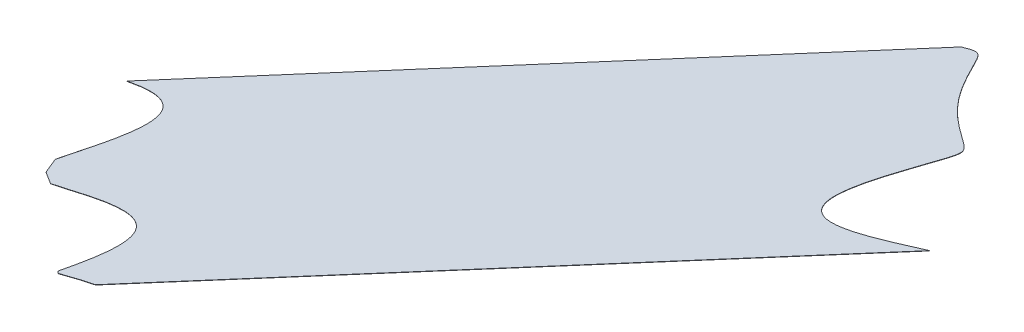
ISO-10303-21;
HEADER;
FILE_DESCRIPTION(('STEP AP214'),'2;1');
FILE_NAME('part.step','',(''),(''),'','','');
FILE_SCHEMA(('AUTOMOTIVE_DESIGN { 1 0 10303 214 1 1 1 1 }'));
ENDSEC;
DATA;
#1=APPLICATION_CONTEXT('core data for automotive mechanical design processes');
#2=APPLICATION_PROTOCOL_DEFINITION('international standard','automotive_design',2000,#1);
#3=PRODUCT_CONTEXT('',#1,'mechanical');
#4=PRODUCT('Part','Part','',(#3));
#5=PRODUCT_RELATED_PRODUCT_CATEGORY('part','',(#4));
#6=PRODUCT_DEFINITION_FORMATION('','',#4);
#7=PRODUCT_DEFINITION_CONTEXT('part definition',#1,'design');
#8=PRODUCT_DEFINITION('design','',#6,#7);
#9=PRODUCT_DEFINITION_SHAPE('','',#8);
#10=(LENGTH_UNIT() NAMED_UNIT(*) SI_UNIT(.MILLI.,.METRE.));
#11=(NAMED_UNIT(*) PLANE_ANGLE_UNIT() SI_UNIT($,.RADIAN.));
#12=(NAMED_UNIT(*) SI_UNIT($,.STERADIAN.) SOLID_ANGLE_UNIT());
#13=UNCERTAINTY_MEASURE_WITH_UNIT(LENGTH_MEASURE(1.E-05),#10,'distance_accuracy_value','');
#14=(GEOMETRIC_REPRESENTATION_CONTEXT(3) GLOBAL_UNCERTAINTY_ASSIGNED_CONTEXT((#13)) GLOBAL_UNIT_ASSIGNED_CONTEXT((#10,
#11,#12)) REPRESENTATION_CONTEXT('',''));
#15=CARTESIAN_POINT('',(0.,0.,0.));
#16=DIRECTION('',(0.,0.,1.));
#17=DIRECTION('',(1.,0.,0.));
#18=AXIS2_PLACEMENT_3D('',#15,#16,#17);
#19=CARTESIAN_POINT('',(2526.18612442201,154.997925680806,134.147987479624));
#20=DIRECTION('',(-0.636420404011801,0.0609268060007244,-0.76893237262324));
#21=DIRECTION('',(-0.770363525853528,0.,0.637604923157374));
#22=AXIS2_PLACEMENT_3D('',#19,#20,#21);
#23=PLANE('',#22);
#24=DIRECTION('',(0.769416763227082,0.120539805596336,-0.627270276461398));
#25=VECTOR('',#24,1.);
#26=CARTESIAN_POINT('',(2526.19157136044,154.898841974801,134.13562826986));
#27=LINE('',#26,#25);
#28=CARTESIAN_POINT('',(2526.19157136044,154.898841974801,134.13562826986));
#29=VERTEX_POINT('',#28);
#30=CARTESIAN_POINT('',(2684.13136642013,179.642301049661,5.37454111102499));
#31=VERTEX_POINT('',#30);
#32=EDGE_CURVE('E161',#29,#31,#27,.T.);
#33=ORIENTED_EDGE('',*,*,#32,.F.);
#34=DIRECTION('',(0.0544693842687489,-0.990837060054451,-0.123592097643965));
#35=VECTOR('',#34,1.);
#36=CARTESIAN_POINT('',(2526.18612442201,154.997925680806,134.147987479624));
#37=LINE('',#36,#35);
#38=CARTESIAN_POINT('',(2526.18612442201,154.997925680806,134.147987479624));
#39=VERTEX_POINT('',#38);
#40=EDGE_CURVE('E13',#39,#29,#37,.T.);
#41=ORIENTED_EDGE('',*,*,#40,.F.);
#42=DIRECTION('',(0.769416763227082,0.120539805596336,-0.627270276461398));
#43=VECTOR('',#42,1.);
#44=CARTESIAN_POINT('',(2526.18612442201,154.997925680806,134.147987479624));
#45=LINE('',#44,#43);
#46=CARTESIAN_POINT('',(2684.1259194817,179.741384755666,5.38690032078939));
#47=VERTEX_POINT('',#46);
#48=EDGE_CURVE('E227',#39,#47,#45,.T.);
#49=ORIENTED_EDGE('',*,*,#48,.T.);
#50=DIRECTION('',(0.0544693842687489,-0.990837060054451,-0.123592097643965));
#51=VECTOR('',#50,1.);
#52=CARTESIAN_POINT('',(2684.1259194817,179.741384755666,5.38690032078939));
#53=LINE('',#52,#51);
#54=EDGE_CURVE('E110',#47,#31,#53,.T.);
#55=ORIENTED_EDGE('',*,*,#54,.T.);
#56=EDGE_LOOP('',(#33,#41,#49,#55));
#57=FACE_BOUND('',#56,.T.);
#58=ADVANCED_FACE('F55',(#57),#23,.T.);
#59=CARTESIAN_POINT('',(2526.18612442201,154.997925680806,134.147987479624));
#60=CARTESIAN_POINT('',(2527.74584101399,155.113006093001,133.912785266505));
#61=CARTESIAN_POINT('',(2529.12018096937,155.205204682554,133.779327476054));
#62=CARTESIAN_POINT('',(2530.70036815862,155.311212682619,133.62588051415));
#63=CARTESIAN_POINT('',(2532.06566331949,155.389004789134,133.603933193824));
#64=CARTESIAN_POINT('',(2533.69095169273,155.48161084962,133.577806444406));
#65=CARTESIAN_POINT('',(2535.03808710249,155.535734204732,133.737608006263));
#66=CARTESIAN_POINT('',(2536.68012895446,155.601705905586,133.93239232466));
#67=CARTESIAN_POINT('',(2537.9351944785,155.611540457041,134.406679996598));
#68=CARTESIAN_POINT('',(2539.46409484854,155.623520747368,134.984449510008));
#69=CARTESIAN_POINT('',(2540.96744021771,155.514491135964,136.52109206115));
#70=CARTESIAN_POINT('',(2541.69378000524,155.394076599676,137.806566368557));
#71=CARTESIAN_POINT('',(2541.91270004164,155.313259191527,138.550961232247));
#72=CARTESIAN_POINT('',(2542.29045114621,155.173807062343,139.835430148932));
#73=CARTESIAN_POINT('',(2542.26598324431,154.967227528617,141.4807934868));
#74=CARTESIAN_POINT('',(2542.24608597631,154.799237303549,142.818800947956));
#75=CARTESIAN_POINT('',(2541.96009800397,154.584627551489,144.413285634158));
#76=CARTESIAN_POINT('',(2541.72191587425,154.405892035492,145.741235740815));
#77=CARTESIAN_POINT('',(2541.29605020046,154.192464781245,147.26459359047));
#78=CARTESIAN_POINT('',(2540.92753432657,154.007779008354,148.582806312858));
#79=CARTESIAN_POINT('',(2540.41278524443,153.794282185848,150.067549284975));
#80=CARTESIAN_POINT('',(2539.96429749972,153.608267850416,151.361167962774));
#81=CARTESIAN_POINT('',(2539.39542158973,153.39652432958,152.808000005733));
#82=CARTESIAN_POINT('',(2538.8977102795,153.211269261939,154.073837878486));
#83=CARTESIAN_POINT('',(2538.29048479369,152.999915775266,155.500641633774));
#84=CARTESIAN_POINT('',(2537.76966199564,152.818635975788,156.724424135426));
#85=CARTESIAN_POINT('',(2537.12523626788,152.603322511122,158.166580156076));
#86=CARTESIAN_POINT('',(2536.85054073258,152.511542116756,158.781319454977));
#87=CARTESIAN_POINT('',(2536.52703786203,152.404756606465,159.494844353294));
#88=CARTESIAN_POINT('',(2536.28130634098,152.323642748574,160.036835088245));
#89=CARTESIAN_POINT('',(2535.92238754405,152.205880023118,160.822755779413));
#90=CARTESIAN_POINT('',(2535.36763722174,152.023864173122,162.037486689209));
#91=CARTESIAN_POINT('',(2535.31510150696,152.006593612383,162.152791177626));
#92=CARTESIAN_POINT('',(2534.95369623408,151.887785450319,162.945997290264));
#93=CARTESIAN_POINT('',(2534.71116529873,151.806868094609,163.487823227367));
#94=CARTESIAN_POINT('',(2534.36646628782,151.691863662543,164.2578976277));
#95=CARTESIAN_POINT('',(2534.12268133216,151.607112846838,164.829903718617));
#96=CARTESIAN_POINT('',(2533.78774337376,151.490673072658,165.615787128729));
#97=CARTESIAN_POINT('',(2533.57448051185,151.407438692909,166.18908762853));
#98=B_SPLINE_CURVE_WITH_KNOTS('',2,(#59,#60,#61,#62,#63,#64,#65,#66,#67,#68,#69,#70,#71,#72,#73,
#74,#75,#76,#77,#78,#79,#80,#81,#82,#83,#84,#85,#86,#87,#88,#89,#90,#91,#92,#93,#94,#95,#96,
#97),.UNSPECIFIED.,.F.,.F.,(3,2,2,2,2,1,1,2,2,2,2,2,2,2,2,2,2,2,2,2,3),(0.,0.0625,0.125,0.1875,
0.25,0.3125,0.34375,0.375,0.4375,0.5,0.5625,0.625,0.6875,0.75,0.8125,0.84375,0.875,0.90625,
0.9375,0.96875,1.),.UNSPECIFIED.);
#99=DIRECTION('',(0.0544693842687489,-0.990837060054451,-0.123592097643965));
#100=VECTOR('',#99,1.);
#101=SURFACE_OF_LINEAR_EXTRUSION('',#98,#100);
#102=CARTESIAN_POINT('',(2526.19157136044,154.898841974801,134.13562826986));
#103=CARTESIAN_POINT('',(2527.75128795242,155.013922386995,133.90042605674));
#104=CARTESIAN_POINT('',(2529.12562790779,155.106120976548,133.76696826629));
#105=CARTESIAN_POINT('',(2530.70581509704,155.212128976613,133.613521304386));
#106=CARTESIAN_POINT('',(2532.07111025791,155.289921083128,133.59157398406));
#107=CARTESIAN_POINT('',(2533.69639863116,155.382527143614,133.565447234641));
#108=CARTESIAN_POINT('',(2535.04353404092,155.436650498726,133.725248796498));
#109=CARTESIAN_POINT('',(2536.68557589288,155.50262219958,133.920033114895));
#110=CARTESIAN_POINT('',(2537.94064141693,155.512456751035,134.394320786834));
#111=CARTESIAN_POINT('',(2539.46954178697,155.524437041363,134.972090300244));
#112=CARTESIAN_POINT('',(2540.97288715614,155.415407429959,136.508732851386));
#113=CARTESIAN_POINT('',(2541.69922694367,155.294992893671,137.794207158792));
#114=CARTESIAN_POINT('',(2541.91814698007,155.214175485521,138.538602022482));
#115=CARTESIAN_POINT('',(2542.29589808464,155.074723356338,139.823070939167));
#116=CARTESIAN_POINT('',(2542.27143018274,154.868143822612,141.468434277035));
#117=CARTESIAN_POINT('',(2542.25153291474,154.700153597544,142.806441738192));
#118=CARTESIAN_POINT('',(2541.9655449424,154.485543845484,144.400926424394));
#119=CARTESIAN_POINT('',(2541.72736281267,154.306808329486,145.72887653105));
#120=CARTESIAN_POINT('',(2541.30149713889,154.093381075239,147.252234380706));
#121=CARTESIAN_POINT('',(2540.932981265,153.908695302348,148.570447103094));
#122=CARTESIAN_POINT('',(2540.41823218286,153.695198479842,150.05519007521));
#123=CARTESIAN_POINT('',(2539.96974443815,153.509184144411,151.348808753009));
#124=CARTESIAN_POINT('',(2539.40086852815,153.297440623575,152.795640795968));
#125=CARTESIAN_POINT('',(2538.90315721793,153.112185555933,154.061478668722));
#126=CARTESIAN_POINT('',(2538.29593173211,152.90083206926,155.48828242401));
#127=CARTESIAN_POINT('',(2537.77510893406,152.719552269782,156.712064925662));
#128=CARTESIAN_POINT('',(2537.13068320631,152.504238805116,158.154220946312));
#129=CARTESIAN_POINT('',(2536.85598767101,152.41245841075,158.768960245212));
#130=CARTESIAN_POINT('',(2536.53248480046,152.30567290046,159.48248514353));
#131=CARTESIAN_POINT('',(2536.28675327941,152.224559042568,160.024475878481));
#132=CARTESIAN_POINT('',(2535.92783448248,152.106796317113,160.810396569649));
#133=CARTESIAN_POINT('',(2535.37308416017,151.924780467116,162.025127479444));
#134=CARTESIAN_POINT('',(2535.32054844538,151.907509906378,162.140431967862));
#135=CARTESIAN_POINT('',(2534.95914317251,151.788701744314,162.933638080499));
#136=CARTESIAN_POINT('',(2534.71661223716,151.707784388603,163.475464017602));
#137=CARTESIAN_POINT('',(2534.37191322624,151.592779956537,164.245538417935));
#138=CARTESIAN_POINT('',(2534.12812827059,151.508029140833,164.817544508853));
#139=CARTESIAN_POINT('',(2533.79319031218,151.391589366653,165.603427918964));
#140=CARTESIAN_POINT('',(2533.57992745027,151.308354986904,166.176728418765));
#141=B_SPLINE_CURVE_WITH_KNOTS('',2,(#102,#103,#104,#105,#106,#107,#108,#109,#110,#111,#112,
#113,#114,#115,#116,#117,#118,#119,#120,#121,#122,#123,#124,#125,#126,#127,#128,#129,#130,#131,
#132,#133,#134,#135,#136,#137,#138,#139,#140),.UNSPECIFIED.,.F.,.F.,(3,2,2,2,2,1,1,2,2,2,2,2,2,
2,2,2,2,2,2,2,3),(0.,0.0625,0.125,0.1875,0.25,0.3125,0.34375,0.375,0.4375,0.5,0.5625,0.625,
0.6875,0.75,0.8125,0.84375,0.875,0.90625,0.9375,0.96875,1.),.UNSPECIFIED.);
#142=CARTESIAN_POINT('',(2533.57992771344,151.308354910784,166.176729144992));
#143=VERTEX_POINT('',#142);
#144=EDGE_CURVE('E263',#29,#143,#141,.T.);
#145=ORIENTED_EDGE('',*,*,#144,.T.);
#146=DIRECTION('',(0.0544693842687489,-0.990837060054451,-0.123592097643965));
#147=VECTOR('',#146,1.);
#148=CARTESIAN_POINT('',(2533.57448077501,151.40743861679,166.189088354756));
#149=LINE('',#148,#147);
#150=CARTESIAN_POINT('',(2533.57448077501,151.40743861679,166.189088354756));
#151=VERTEX_POINT('',#150);
#152=EDGE_CURVE('E63',#151,#143,#149,.T.);
#153=ORIENTED_EDGE('',*,*,#152,.F.);
#154=EDGE_CURVE('E222',#39,#151,#98,.T.);
#155=ORIENTED_EDGE('',*,*,#154,.F.);
#156=ORIENTED_EDGE('',*,*,#40,.T.);
#157=EDGE_LOOP('',(#145,#153,#155,#156));
#158=FACE_BOUND('',#157,.T.);
#159=ADVANCED_FACE('F218',(#158),#101,.F.);
#160=CARTESIAN_POINT('',(2533.57448051187,151.407438692909,166.189087628538));
#161=CARTESIAN_POINT('',(2533.76626225872,151.351960366577,166.718378875083));
#162=CARTESIAN_POINT('',(2533.99091877641,151.283377034287,167.367221406714));
#163=CARTESIAN_POINT('',(2534.01006938824,151.277516302524,167.42264689423));
#164=CARTESIAN_POINT('',(2534.16452147991,151.230151542958,167.870439839778));
#165=CARTESIAN_POINT('',(2534.40426638145,151.154934331796,168.579115873374));
#166=CARTESIAN_POINT('',(2534.42442009463,151.148606602332,168.638727364295));
#167=CARTESIAN_POINT('',(2534.57041701832,151.10277069501,169.070537158055));
#168=CARTESIAN_POINT('',(2534.6210109543,151.086947113548,169.219692418202));
#169=CARTESIAN_POINT('',(2534.62932022373,151.084350004354,169.244175478896));
#170=CARTESIAN_POINT('',(2534.74268764328,151.048945215253,169.57797862222));
#171=CARTESIAN_POINT('',(2534.82880881869,151.022575506843,169.827339644));
#172=CARTESIAN_POINT('',(2534.84578512168,151.017384765607,169.876435562528));
#173=CARTESIAN_POINT('',(2535.09716485421,150.940874538191,170.600605390144));
#174=CARTESIAN_POINT('',(2535.27382035103,150.893559613618,171.057784271131));
#175=B_SPLINE_CURVE_WITH_KNOTS('',2,(#160,#161,#162,#163,#164,#165,#166,#167,#168,#169,#170,
#171,#172,#173,#174),.UNSPECIFIED.,.F.,.F.,(3,1,1,1,1,1,1,1,1,1,1,1,1,3),(0.,0.2375,0.25,0.2625,
0.488125,0.5,0.50625,0.6190625,0.625,0.63125,0.7440625,0.75,0.7625,1.),.UNSPECIFIED.);
#176=DIRECTION('',(0.0544693842687489,-0.990837060054451,-0.123592097643965));
#177=VECTOR('',#176,1.);
#178=SURFACE_OF_LINEAR_EXTRUSION('',#175,#177);
#179=CARTESIAN_POINT('',(2533.5799274503,151.308354986904,166.176728418773));
#180=CARTESIAN_POINT('',(2533.77170919715,151.252876660571,166.706019665318));
#181=CARTESIAN_POINT('',(2533.99636571484,151.184293328282,167.35486219695));
#182=CARTESIAN_POINT('',(2534.01551632667,151.178432596518,167.410287684466));
#183=CARTESIAN_POINT('',(2534.16996841834,151.131067836953,167.858080630014));
#184=CARTESIAN_POINT('',(2534.40971331988,151.05585062579,168.56675666361));
#185=CARTESIAN_POINT('',(2534.42986703306,151.049522896326,168.626368154531));
#186=CARTESIAN_POINT('',(2534.57586395675,151.003686989005,169.05817794829));
#187=CARTESIAN_POINT('',(2534.62645789273,150.987863407542,169.207333208438));
#188=CARTESIAN_POINT('',(2534.63476716215,150.985266298348,169.231816269131));
#189=CARTESIAN_POINT('',(2534.74813458171,150.949861509247,169.565619412456));
#190=CARTESIAN_POINT('',(2534.83425575712,150.923491800838,169.814980434235));
#191=CARTESIAN_POINT('',(2534.85123206011,150.918301059602,169.864076352764));
#192=CARTESIAN_POINT('',(2535.10261179264,150.841790832186,170.58824618038));
#193=CARTESIAN_POINT('',(2535.27926728946,150.794475907613,171.045425061367));
#194=B_SPLINE_CURVE_WITH_KNOTS('',2,(#179,#180,#181,#182,#183,#184,#185,#186,#187,#188,#189,
#190,#191,#192,#193),.UNSPECIFIED.,.F.,.F.,(3,1,1,1,1,1,1,1,1,1,1,1,1,3),(0.,0.2375,0.25,0.2625,
0.488125,0.5,0.50625,0.6190625,0.625,0.63125,0.7440625,0.75,0.7625,1.),.UNSPECIFIED.);
#195=CARTESIAN_POINT('',(2535.27926698278,150.794475989751,171.045424267712));
#196=VERTEX_POINT('',#195);
#197=EDGE_CURVE('E259',#143,#196,#194,.T.);
#198=ORIENTED_EDGE('',*,*,#197,.T.);
#199=DIRECTION('',(0.0544693842687489,-0.990837060054451,-0.123592097643965));
#200=VECTOR('',#199,1.);
#201=CARTESIAN_POINT('',(2535.27382004436,150.893559695756,171.057783477477));
#202=LINE('',#201,#200);
#203=CARTESIAN_POINT('',(2535.27382004436,150.893559695756,171.057783477477));
#204=VERTEX_POINT('',#203);
#205=EDGE_CURVE('E252',#204,#196,#202,.T.);
#206=ORIENTED_EDGE('',*,*,#205,.F.);
#207=EDGE_CURVE('E204',#151,#204,#175,.T.);
#208=ORIENTED_EDGE('',*,*,#207,.F.);
#209=ORIENTED_EDGE('',*,*,#152,.T.);
#210=EDGE_LOOP('',(#198,#206,#208,#209));
#211=FACE_BOUND('',#210,.T.);
#212=ADVANCED_FACE('F215',(#211),#178,.F.);
#213=CARTESIAN_POINT('',(2535.27382035103,150.893559613618,171.057784271132));
#214=CARTESIAN_POINT('',(2535.6607692615,150.883167305677,171.311635070193));
#215=CARTESIAN_POINT('',(2536.25915119824,150.869983610078,171.681046955826));
#216=CARTESIAN_POINT('',(2536.30486293245,150.868984248934,171.709204857018));
#217=CARTESIAN_POINT('',(2536.62973304053,150.861918152612,171.909030131704));
#218=CARTESIAN_POINT('',(2537.93554082923,150.834749421358,172.70233596512));
#219=CARTESIAN_POINT('',(2538.32193767474,150.826395492039,172.939601790233));
#220=CARTESIAN_POINT('',(2538.36815729251,150.825392547848,172.968012250622));
#221=CARTESIAN_POINT('',(2538.91766945873,150.813418116256,173.30619163857));
#222=CARTESIAN_POINT('',(2539.36175477393,150.802826477522,173.58682156983));
#223=B_SPLINE_CURVE_WITH_KNOTS('',2,(#213,#214,#215,#216,#217,#218,#219,#220,#221,#222),
.UNSPECIFIED.,.F.,.F.,(3,1,1,1,1,1,1,1,3),(0.,0.2375,0.25,0.2625,0.5,0.7375,0.75,0.7625,1.),.UNSPECIFIED.);
#224=DIRECTION('',(0.0544693842687489,-0.990837060054451,-0.123592097643965));
#225=VECTOR('',#224,1.);
#226=SURFACE_OF_LINEAR_EXTRUSION('',#223,#225);
#227=CARTESIAN_POINT('',(2535.27926728946,150.794475907613,171.045425061367));
#228=CARTESIAN_POINT('',(2535.66621619993,150.784083599672,171.299275860428));
#229=CARTESIAN_POINT('',(2536.26459813667,150.770899904073,171.668687746061));
#230=CARTESIAN_POINT('',(2536.31030987087,150.769900542929,171.696845647253));
#231=CARTESIAN_POINT('',(2536.63517997895,150.762834446606,171.896670921939));
#232=CARTESIAN_POINT('',(2537.94098776766,150.735665715352,172.689976755356));
#233=CARTESIAN_POINT('',(2538.32738461317,150.727311786033,172.927242580469));
#234=CARTESIAN_POINT('',(2538.37360423094,150.726308841842,172.955653040857));
#235=CARTESIAN_POINT('',(2538.92311639716,150.714334410251,173.293832428805));
#236=CARTESIAN_POINT('',(2539.36720171236,150.703742771516,173.574462360066));
#237=B_SPLINE_CURVE_WITH_KNOTS('',2,(#227,#228,#229,#230,#231,#232,#233,#234,#235,#236),
.UNSPECIFIED.,.F.,.F.,(3,1,1,1,1,1,1,1,3),(0.,0.2375,0.25,0.2625,0.5,0.7375,0.75,0.7625,1.),.UNSPECIFIED.);
#238=CARTESIAN_POINT('',(2539.36720104685,150.703742787389,173.574461939516));
#239=VERTEX_POINT('',#238);
#240=EDGE_CURVE('E265',#196,#239,#237,.T.);
#241=ORIENTED_EDGE('',*,*,#240,.T.);
#242=DIRECTION('',(0.0544693842687489,-0.990837060054451,-0.123592097643965));
#243=VECTOR('',#242,1.);
#244=CARTESIAN_POINT('',(2539.36175410843,150.802826493394,173.58682114928));
#245=LINE('',#244,#243);
#246=CARTESIAN_POINT('',(2539.36175410843,150.802826493394,173.58682114928));
#247=VERTEX_POINT('',#246);
#248=EDGE_CURVE('E249',#247,#239,#245,.T.);
#249=ORIENTED_EDGE('',*,*,#248,.F.);
#250=EDGE_CURVE('E196',#204,#247,#223,.T.);
#251=ORIENTED_EDGE('',*,*,#250,.F.);
#252=ORIENTED_EDGE('',*,*,#205,.T.);
#253=EDGE_LOOP('',(#241,#249,#251,#252));
#254=FACE_BOUND('',#253,.T.);
#255=ADVANCED_FACE('F212',(#254),#226,.F.);
#256=CARTESIAN_POINT('',(2539.36175477393,150.802826477522,173.58682156983));
#257=CARTESIAN_POINT('',(2540.04754033345,150.850757736676,173.504795688478));
#258=CARTESIAN_POINT('',(2541.06805848064,150.929421063225,173.323914025926));
#259=CARTESIAN_POINT('',(2541.75368615666,150.98227044559,173.20238999985));
#260=CARTESIAN_POINT('',(2542.76110458592,151.062181218749,173.005734271334));
#261=CARTESIAN_POINT('',(2543.29369163548,151.104427262368,172.901769234376));
#262=CARTESIAN_POINT('',(2545.55879706965,151.285253851179,172.450358598926));
#263=CARTESIAN_POINT('',(2546.14119149716,151.331537527037,172.335974947236));
#264=CARTESIAN_POINT('',(2547.06492635063,151.404947989978,172.154551223483));
#265=CARTESIAN_POINT('',(2547.83543458176,151.465455527226,172.009040290849));
#266=CARTESIAN_POINT('',(2548.72821008628,151.535564638215,171.840439111723));
#267=CARTESIAN_POINT('',(2549.52875964595,151.597290728696,171.698398829501));
#268=CARTESIAN_POINT('',(2551.3583366212,151.738359613882,171.373779789024));
#269=CARTESIAN_POINT('',(2552.91846367646,151.851929441804,171.150868819358));
#270=CARTESIAN_POINT('',(2554.75192723309,151.985396866734,170.888903527571));
#271=CARTESIAN_POINT('',(2556.33346252007,152.089726639016,170.74950503939));
#272=CARTESIAN_POINT('',(2558.20733176083,152.213340922417,170.584339872758));
#273=CARTESIAN_POINT('',(2559.79267111459,152.300382223502,170.585219472572));
#274=CARTESIAN_POINT('',(2561.705373419,152.405397024762,170.586280704408));
#275=CARTESIAN_POINT('',(2563.24704444886,152.459872250901,170.828996860208));
#276=CARTESIAN_POINT('',(2565.17115950817,152.527861206355,171.131923879962));
#277=CARTESIAN_POINT('',(2566.56288814662,152.518693818805,171.818780005493));
#278=CARTESIAN_POINT('',(2567.38489730682,152.513279202526,172.224463995411));
#279=CARTESIAN_POINT('',(2568.36123431701,152.464369999202,173.046859026753));
#280=CARTESIAN_POINT('',(2568.93677505591,152.416456080781,173.684636338054));
#281=CARTESIAN_POINT('',(2569.35784934826,152.36174520418,174.308828523727));
#282=CARTESIAN_POINT('',(2570.13419403967,152.223883767508,175.756212631108));
#283=CARTESIAN_POINT('',(2570.34315914198,152.045137779755,177.281312965607));
#284=CARTESIAN_POINT('',(2570.55167537407,151.866775749659,178.803137288386));
#285=CARTESIAN_POINT('',(2570.35063510306,151.617387213156,180.713881333081));
#286=CARTESIAN_POINT('',(2570.18794556386,151.415572393264,182.260129090285));
#287=CARTESIAN_POINT('',(2569.75393894397,151.163356490746,184.090867416677));
#288=CARTESIAN_POINT('',(2569.39279850794,150.953485588239,185.614239658392));
#289=CARTESIAN_POINT('',(2568.83541890139,150.703918415677,187.369370315684));
#290=CARTESIAN_POINT('',(2568.35771892067,150.490027860444,188.873598083073));
#291=CARTESIAN_POINT('',(2567.71885410732,150.239487207768,190.600621046329));
#292=CARTESIAN_POINT('',(2567.1809177512,150.028527200351,192.054807316081));
#293=CARTESIAN_POINT('',(2566.48619047314,149.775186222548,193.779660819104));
#294=CARTESIAN_POINT('',(2566.19204951529,149.667924048991,194.50994747627));
#295=CARTESIAN_POINT('',(2565.8437696694,149.543537735931,195.353658214834));
#296=CARTESIAN_POINT('',(2565.57554919918,149.447744207335,196.003424469445));
#297=CARTESIAN_POINT('',(2565.19123690568,149.311938496001,196.922804267415));
#298=B_SPLINE_CURVE_WITH_KNOTS('',2,(#256,#257,#258,#259,#260,#261,#262,#263,#264,#265,#266,
#267,#268,#269,#270,#271,#272,#273,#274,#275,#276,#277,#278,#279,#280,#281,#282,#283,#284,#285,
#286,#287,#288,#289,#290,#291,#292,#293,#294,#295,#296,#297),.UNSPECIFIED.,.F.,.F.,(3,2,2,1,2,2,
2,2,2,2,2,2,1,1,1,1,2,2,2,2,2,2,2,3),(0.,0.03125,0.0625,0.09375,0.125,0.15625,0.1875,0.25,
0.3125,0.375,0.4375,0.5,0.53125,0.546875,0.5625,0.573954582214355,0.625,0.6875,0.75,0.8125,
0.875,0.9375,0.96875,1.),.UNSPECIFIED.);
#299=DIRECTION('',(0.0544693842687489,-0.990837060054451,-0.123592097643965));
#300=VECTOR('',#299,1.);
#301=SURFACE_OF_LINEAR_EXTRUSION('',#298,#300);
#302=CARTESIAN_POINT('',(2539.36720171236,150.703742771516,173.574462360066));
#303=CARTESIAN_POINT('',(2540.05298727187,150.75167403067,173.492436478714));
#304=CARTESIAN_POINT('',(2541.07350541907,150.83033735722,173.311554816162));
#305=CARTESIAN_POINT('',(2541.75913309509,150.883186739584,173.190030790086));
#306=CARTESIAN_POINT('',(2542.76655152435,150.963097512743,172.99337506157));
#307=CARTESIAN_POINT('',(2543.29913857391,151.005343556363,172.889410024612));
#308=CARTESIAN_POINT('',(2545.56424400807,151.186170145173,172.437999389162));
#309=CARTESIAN_POINT('',(2546.14663843559,151.232453821032,172.323615737472));
#310=CARTESIAN_POINT('',(2547.07037328905,151.305864283972,172.142192013719));
#311=CARTESIAN_POINT('',(2547.84088152019,151.36637182122,171.996681081085));
#312=CARTESIAN_POINT('',(2548.73365702471,151.436480932209,171.828079901959));
#313=CARTESIAN_POINT('',(2549.53420658438,151.498207022691,171.686039619737));
#314=CARTESIAN_POINT('',(2551.36378355963,151.639275907876,171.36142057926));
#315=CARTESIAN_POINT('',(2552.92391061489,151.752845735799,171.138509609594));
#316=CARTESIAN_POINT('',(2554.75737417152,151.886313160729,170.876544317807));
#317=CARTESIAN_POINT('',(2556.3389094585,151.990642933011,170.737145829626));
#318=CARTESIAN_POINT('',(2558.21277869925,152.114257216412,170.571980662994));
#319=CARTESIAN_POINT('',(2559.79811805302,152.201298517497,170.572860262808));
#320=CARTESIAN_POINT('',(2561.71082035743,152.306313318756,170.573921494643));
#321=CARTESIAN_POINT('',(2563.25249138729,152.360788544896,170.816637650444));
#322=CARTESIAN_POINT('',(2565.1766064466,152.42877750035,171.119564670197));
#323=CARTESIAN_POINT('',(2566.56833508505,152.4196101128,171.806420795728));
#324=CARTESIAN_POINT('',(2567.39034424525,152.414195496521,172.212104785647));
#325=CARTESIAN_POINT('',(2568.36668125543,152.365286293196,173.034499816989));
#326=CARTESIAN_POINT('',(2568.94222199434,152.317372374775,173.67227712829));
#327=CARTESIAN_POINT('',(2569.36329628669,152.262661498174,174.296469313963));
#328=CARTESIAN_POINT('',(2570.1396409781,152.124800061503,175.743853421344));
#329=CARTESIAN_POINT('',(2570.34860608041,151.94605407375,177.268953755843));
#330=CARTESIAN_POINT('',(2570.5571223125,151.767692043654,178.790778078622));
#331=CARTESIAN_POINT('',(2570.35608204149,151.518303507151,180.701522123317));
#332=CARTESIAN_POINT('',(2570.19339250229,151.316488687258,182.247769880521));
#333=CARTESIAN_POINT('',(2569.7593858824,151.06427278474,184.078508206913));
#334=CARTESIAN_POINT('',(2569.39824544636,150.854401882233,185.601880448628));
#335=CARTESIAN_POINT('',(2568.84086583982,150.604834709672,187.35701110592));
#336=CARTESIAN_POINT('',(2568.3631658591,150.390944154439,188.861238873308));
#337=CARTESIAN_POINT('',(2567.72430104575,150.140403501762,190.588261836564));
#338=CARTESIAN_POINT('',(2567.18636468963,149.929443494346,192.042448106317));
#339=CARTESIAN_POINT('',(2566.49163741157,149.676102516543,193.76730160934));
#340=CARTESIAN_POINT('',(2566.19749645372,149.568840342985,194.497588266506));
#341=CARTESIAN_POINT('',(2565.84921660782,149.444454029926,195.34129900507));
#342=CARTESIAN_POINT('',(2565.58099613761,149.348660501329,195.991065259681));
#343=CARTESIAN_POINT('',(2565.19668384411,149.212854789996,196.91044505765));
#344=B_SPLINE_CURVE_WITH_KNOTS('',2,(#302,#303,#304,#305,#306,#307,#308,#309,#310,#311,#312,
#313,#314,#315,#316,#317,#318,#319,#320,#321,#322,#323,#324,#325,#326,#327,#328,#329,#330,#331,
#332,#333,#334,#335,#336,#337,#338,#339,#340,#341,#342,#343),.UNSPECIFIED.,.F.,.F.,(3,2,2,1,2,2,
2,2,2,2,2,2,1,1,1,1,2,2,2,2,2,2,2,3),(0.,0.03125,0.0625,0.09375,0.125,0.15625,0.1875,0.25,
0.3125,0.375,0.4375,0.5,0.53125,0.546875,0.5625,0.573954582214355,0.625,0.6875,0.75,0.8125,
0.875,0.9375,0.96875,1.),.UNSPECIFIED.);
#345=CARTESIAN_POINT('',(2565.19668404952,149.212854862582,196.910444566254));
#346=VERTEX_POINT('',#345);
#347=EDGE_CURVE('E267',#239,#346,#344,.T.);
#348=ORIENTED_EDGE('',*,*,#347,.T.);
#349=DIRECTION('',(0.0544693842687489,-0.990837060054451,-0.123592097643965));
#350=VECTOR('',#349,1.);
#351=CARTESIAN_POINT('',(2565.19123711109,149.311938568588,196.922803776018));
#352=LINE('',#351,#350);
#353=CARTESIAN_POINT('',(2565.19123711109,149.311938568588,196.922803776018));
#354=VERTEX_POINT('',#353);
#355=EDGE_CURVE('E246',#354,#346,#352,.T.);
#356=ORIENTED_EDGE('',*,*,#355,.F.);
#357=EDGE_CURVE('E188',#247,#354,#298,.T.);
#358=ORIENTED_EDGE('',*,*,#357,.F.);
#359=ORIENTED_EDGE('',*,*,#248,.T.);
#360=EDGE_LOOP('',(#348,#356,#358,#359));
#361=FACE_BOUND('',#360,.T.);
#362=ADVANCED_FACE('F181',(#361),#301,.F.);
#363=CARTESIAN_POINT('',(2565.19123690568,149.311938496001,196.922804267414));
#364=CARTESIAN_POINT('',(2565.49088719377,149.292242113994,197.212771608476));
#365=CARTESIAN_POINT('',(2565.77566291156,149.27042532555,197.513182728866));
#366=B_SPLINE_CURVE_WITH_KNOTS('',2,(#363,#364,#365),.UNSPECIFIED.,.F.,.F.,(3,3),(0.,1.),.UNSPECIFIED.);
#367=DIRECTION('',(0.0544693842687489,-0.990837060054451,-0.123592097643965));
#368=VECTOR('',#367,1.);
#369=SURFACE_OF_LINEAR_EXTRUSION('',#366,#368);
#370=CARTESIAN_POINT('',(2565.19668384411,149.212854789996,196.91044505765));
#371=CARTESIAN_POINT('',(2565.4963341322,149.193158407988,197.200412398712));
#372=CARTESIAN_POINT('',(2565.78110984999,149.171341619544,197.500823519101));
#373=B_SPLINE_CURVE_WITH_KNOTS('',2,(#370,#371,#372),.UNSPECIFIED.,.F.,.F.,(3,3),(0.,1.),.UNSPECIFIED.);
#374=CARTESIAN_POINT('',(2565.78110945363,149.17134164991,197.500823100975));
#375=VERTEX_POINT('',#374);
#376=EDGE_CURVE('E285',#346,#375,#373,.T.);
#377=ORIENTED_EDGE('',*,*,#376,.T.);
#378=DIRECTION('',(0.0544693842687489,-0.990837060054451,-0.123592097643965));
#379=VECTOR('',#378,1.);
#380=CARTESIAN_POINT('',(2565.7756625152,149.270425355915,197.51318231074));
#381=LINE('',#380,#379);
#382=CARTESIAN_POINT('',(2565.7756625152,149.270425355915,197.51318231074));
#383=VERTEX_POINT('',#382);
#384=EDGE_CURVE('E147',#383,#375,#381,.T.);
#385=ORIENTED_EDGE('',*,*,#384,.F.);
#386=EDGE_CURVE('E138',#354,#383,#366,.T.);
#387=ORIENTED_EDGE('',*,*,#386,.F.);
#388=ORIENTED_EDGE('',*,*,#355,.T.);
#389=EDGE_LOOP('',(#377,#385,#387,#388));
#390=FACE_BOUND('',#389,.T.);
#391=ADVANCED_FACE('F178',(#390),#369,.F.);
#392=CARTESIAN_POINT('',(2565.77566291156,149.27042532555,197.513182728866));
#393=CARTESIAN_POINT('',(2566.6126485873,149.340729368809,197.318431142052));
#394=CARTESIAN_POINT('',(2567.09671843697,149.381299267134,197.206521299985));
#395=CARTESIAN_POINT('',(2567.15659615244,149.386316499791,197.192687423907));
#396=CARTESIAN_POINT('',(2567.8501940986,149.444418203527,197.032568220229));
#397=CARTESIAN_POINT('',(2568.43581695183,149.493188458347,196.899672509352));
#398=CARTESIAN_POINT('',(2568.53816494733,149.501708783308,196.876471823436));
#399=CARTESIAN_POINT('',(2569.92382093503,149.616951797862,196.563254214772));
#400=CARTESIAN_POINT('',(2571.09720297107,149.712527570259,196.314155600004));
#401=CARTESIAN_POINT('',(2571.22700307342,149.723086277229,196.286711883261));
#402=CARTESIAN_POINT('',(2572.58452627347,149.833336677126,196.001121380797));
#403=CARTESIAN_POINT('',(2573.79479549086,149.928394574631,195.772431447007));
#404=CARTESIAN_POINT('',(2573.92677102281,149.938739407601,195.747661109886));
#405=CARTESIAN_POINT('',(2575.35591173647,150.050489803685,195.481608345705));
#406=CARTESIAN_POINT('',(2576.57527125584,150.140899702065,195.294187659997));
#407=B_SPLINE_CURVE_WITH_KNOTS('',2,(#392,#393,#394,#395,#396,#397,#398,#399,#400,#401,#402,
#403,#404,#405,#406),.UNSPECIFIED.,.F.,.F.,(3,1,1,1,1,1,1,1,1,1,1,1,1,3),(0.,0.11875,0.125,
0.13125,0.2440625,0.25,0.2625,0.488125,0.5,0.5125,0.738125,0.75,0.7625,1.),.UNSPECIFIED.);
#408=DIRECTION('',(0.0544693842687489,-0.990837060054451,-0.123592097643965));
#409=VECTOR('',#408,1.);
#410=SURFACE_OF_LINEAR_EXTRUSION('',#407,#409);
#411=CARTESIAN_POINT('',(2565.78110984999,149.171341619544,197.500823519101));
#412=CARTESIAN_POINT('',(2566.61809552572,149.241645662804,197.306071932287));
#413=CARTESIAN_POINT('',(2567.1021653754,149.282215561128,197.194162090221));
#414=CARTESIAN_POINT('',(2567.16204309087,149.287232793786,197.180328214143));
#415=CARTESIAN_POINT('',(2567.85564103703,149.345334497521,197.020209010464));
#416=CARTESIAN_POINT('',(2568.44126389026,149.394104752341,196.887313299588));
#417=CARTESIAN_POINT('',(2568.54361188576,149.402625077302,196.864112613672));
#418=CARTESIAN_POINT('',(2569.92926787346,149.517868091856,196.550895005008));
#419=CARTESIAN_POINT('',(2571.1026499095,149.613443864253,196.30179639024));
#420=CARTESIAN_POINT('',(2571.23245001185,149.624002571224,196.274352673496));
#421=CARTESIAN_POINT('',(2572.58997321189,149.734252971121,195.988762171032));
#422=CARTESIAN_POINT('',(2573.80024242929,149.829310868625,195.760072237242));
#423=CARTESIAN_POINT('',(2573.93221796123,149.839655701596,195.735301900121));
#424=CARTESIAN_POINT('',(2575.36135867489,149.95140609768,195.46924913594));
#425=CARTESIAN_POINT('',(2576.58071819426,150.04181599606,195.281828450233));
#426=B_SPLINE_CURVE_WITH_KNOTS('',2,(#411,#412,#413,#414,#415,#416,#417,#418,#419,#420,#421,
#422,#423,#424,#425),.UNSPECIFIED.,.F.,.F.,(3,1,1,1,1,1,1,1,1,1,1,1,1,3),(0.,0.11875,0.125,
0.13125,0.2440625,0.25,0.2625,0.488125,0.5,0.5125,0.738125,0.75,0.7625,1.),.UNSPECIFIED.);
#427=CARTESIAN_POINT('',(2576.58071819426,150.04181599606,195.281828450233));
#428=VERTEX_POINT('',#427);
#429=EDGE_CURVE('E146',#375,#428,#426,.T.);
#430=ORIENTED_EDGE('',*,*,#429,.T.);
#431=DIRECTION('',(0.0544693842687489,-0.990837060054451,-0.123592097643965));
#432=VECTOR('',#431,1.);
#433=CARTESIAN_POINT('',(2576.57527125584,150.140899702065,195.294187659997));
#434=LINE('',#433,#432);
#435=CARTESIAN_POINT('',(2576.57527125584,150.140899702065,195.294187659997));
#436=VERTEX_POINT('',#435);
#437=EDGE_CURVE('E143',#436,#428,#434,.T.);
#438=ORIENTED_EDGE('',*,*,#437,.F.);
#439=EDGE_CURVE('E132',#383,#436,#407,.T.);
#440=ORIENTED_EDGE('',*,*,#439,.F.);
#441=ORIENTED_EDGE('',*,*,#384,.T.);
#442=EDGE_LOOP('',(#430,#438,#440,#441));
#443=FACE_BOUND('',#442,.T.);
#444=ADVANCED_FACE('F144',(#443),#410,.F.);
#445=CARTESIAN_POINT('',(2576.57527125584,150.140899702065,195.294187659997));
#446=DIRECTION('',(-0.636420404011801,0.0609268060007244,-0.76893237262324));
#447=DIRECTION('',(-0.770363525853528,0.,0.637604923157373));
#448=AXIS2_PLACEMENT_3D('',#445,#446,#447);
#449=PLANE('',#448);
#450=DIRECTION('',(0.769416763227082,0.120539805596337,-0.627270276461398));
#451=VECTOR('',#450,1.);
#452=CARTESIAN_POINT('',(2576.58071819426,150.04181599606,195.281828450232));
#453=LINE('',#452,#451);
#454=CARTESIAN_POINT('',(2734.4705644858,174.777449903741,66.5614622362806));
#455=VERTEX_POINT('',#454);
#456=EDGE_CURVE('E103',#428,#455,#453,.T.);
#457=ORIENTED_EDGE('',*,*,#456,.T.);
#458=DIRECTION('',(0.0544693842687489,-0.990837060054451,-0.123592097643965));
#459=VECTOR('',#458,1.);
#460=CARTESIAN_POINT('',(2734.46511754738,174.876533609746,66.573821446045));
#461=LINE('',#460,#459);
#462=CARTESIAN_POINT('',(2734.46511754738,174.876533609746,66.573821446045));
#463=VERTEX_POINT('',#462);
#464=EDGE_CURVE('E148',#463,#455,#461,.T.);
#465=ORIENTED_EDGE('',*,*,#464,.F.);
#466=DIRECTION('',(0.769416763227082,0.120539805596337,-0.627270276461398));
#467=VECTOR('',#466,1.);
#468=CARTESIAN_POINT('',(2576.57527125584,150.140899702065,195.294187659997));
#469=LINE('',#468,#467);
#470=EDGE_CURVE('E136',#436,#463,#469,.T.);
#471=ORIENTED_EDGE('',*,*,#470,.F.);
#472=ORIENTED_EDGE('',*,*,#437,.T.);
#473=EDGE_LOOP('',(#457,#465,#471,#472));
#474=FACE_BOUND('',#473,.T.);
#475=ADVANCED_FACE('F150',(#474),#449,.F.);
#476=CARTESIAN_POINT('',(2734.46511754738,174.876533609746,66.5738214460451));
#477=CARTESIAN_POINT('',(2733.75594981613,174.811970301317,66.7788813934893));
#478=CARTESIAN_POINT('',(2732.5281601543,174.697958808573,67.1518005871085));
#479=CARTESIAN_POINT('',(2732.03779119496,174.652289052795,67.3018198166676));
#480=CARTESIAN_POINT('',(2731.37851472717,174.590788083707,67.5043170362789));
#481=CARTESIAN_POINT('',(2730.05858124481,174.467257546012,67.9129408212894));
#482=CARTESIAN_POINT('',(2729.18159796098,174.385313213641,68.1833848264277));
#483=CARTESIAN_POINT('',(2728.19532400106,174.293156883333,68.4875318778031));
#484=CARTESIAN_POINT('',(2727.42614370487,174.221664495592,68.7216935330492));
#485=CARTESIAN_POINT('',(2725.48468895766,174.04121364908,69.3127308482883));
#486=CARTESIAN_POINT('',(2723.90860361127,173.897819004087,69.7677140646268));
#487=CARTESIAN_POINT('',(2722.01392693722,173.725438434927,70.3146680027887));
#488=CARTESIAN_POINT('',(2720.36820436271,173.581061238454,70.7468378793375));
#489=CARTESIAN_POINT('',(2718.45688321872,173.413383409517,71.2487544451268));
#490=CARTESIAN_POINT('',(2716.7839635836,173.274885550473,71.6218034498898));
#491=CARTESIAN_POINT('',(2714.836678907,173.113673527495,72.0560338787418));
#492=CARTESIAN_POINT('',(2713.15639538374,172.987339571216,72.3283195471401));
#493=CARTESIAN_POINT('',(2711.1630857832,172.837470406614,72.651330294668));
#494=CARTESIAN_POINT('',(2709.50314865721,172.733491312926,72.7533642155999));
#495=CARTESIAN_POINT('',(2707.39375521175,172.601358104232,72.8830255628025));
#496=CARTESIAN_POINT('',(2705.7803528566,172.540704199331,72.6582304781674));
#497=CARTESIAN_POINT('',(2704.76914001082,172.502688878734,72.5173383587734));
#498=CARTESIAN_POINT('',(2703.94376437772,172.49235669066,72.2364127305849));
#499=CARTESIAN_POINT('',(2702.98170986365,172.480313533849,71.9089669496826));
#500=CARTESIAN_POINT('',(2701.48891044801,172.533554803213,70.8242269835195));
#501=CARTESIAN_POINT('',(2700.76197597049,172.640309712404,69.6479997284201));
#502=CARTESIAN_POINT('',(2700.4235582297,172.729082909227,68.7871584501639));
#503=CARTESIAN_POINT('',(2700.2845456019,172.799994339544,68.157396459997));
#504=CARTESIAN_POINT('',(2699.9926146985,172.993050282646,66.4810087006184));
#505=CARTESIAN_POINT('',(2700.30899275791,173.264671465767,64.4428572229555));
#506=CARTESIAN_POINT('',(2700.55113031161,173.472554682882,62.8829734124421));
#507=CARTESIAN_POINT('',(2701.13714009062,173.740131426476,60.9960779994781));
#508=CARTESIAN_POINT('',(2701.63252423086,173.966327779886,59.4009884713374));
#509=CARTESIAN_POINT('',(2702.38162416339,174.23880665815,57.5466696034324));
#510=CARTESIAN_POINT('',(2703.0197166127,174.470907486444,55.9671381993704));
#511=CARTESIAN_POINT('',(2703.85459653861,174.741177088404,54.1683359574499));
#512=CARTESIAN_POINT('',(2704.57386957921,174.974022114795,52.6186161500661));
#513=CARTESIAN_POINT('',(2705.46059034147,175.242067951136,50.8604890639172));
#514=CARTESIAN_POINT('',(2706.22180146424,175.472173617676,49.3512135961765));
#515=CARTESIAN_POINT('',(2707.15243881097,175.742019159516,47.5980131551941));
#516=CARTESIAN_POINT('',(2707.88858560436,175.955470651695,46.2112077714002));
#517=CARTESIAN_POINT('',(2708.89965723757,176.242340922976,44.3569691002407));
#518=CARTESIAN_POINT('',(2709.15900255993,176.315924693439,43.8813468890177));
#519=CARTESIAN_POINT('',(2710.36302692305,176.656631198361,41.6805414074406));
#520=CARTESIAN_POINT('',(2710.66603213679,176.742862320664,41.1227672001956));
#521=CARTESIAN_POINT('',(2711.18140856793,176.889531374693,40.1740585071695));
#522=CARTESIAN_POINT('',(2711.53841145276,176.993317851346,39.4993409348386));
#523=CARTESIAN_POINT('',(2712.04246642331,177.139854732856,38.5467022853877));
#524=CARTESIAN_POINT('',(2712.37961711683,177.244067245775,37.8598199453602));
#525=CARTESIAN_POINT('',(2712.60306756191,177.313135270374,37.404580885969));
#526=CARTESIAN_POINT('',(2712.77316847358,177.36966263636,37.0263680544425));
#527=CARTESIAN_POINT('',(2712.9844582749,177.43987775638,36.5565733117494));
#528=CARTESIAN_POINT('',(2713.12667695523,177.495182167586,36.1758766721169));
#529=CARTESIAN_POINT('',(2713.3106732883,177.56673260555,35.6833479442372));
#530=CARTESIAN_POINT('',(2713.44799385245,177.65288385666,35.0531936926516));
#531=CARTESIAN_POINT('',(2713.48529305091,177.711901947715,34.5964844973765));
#532=CARTESIAN_POINT('',(2713.43475009617,177.765454577022,34.1448781692375));
#533=CARTESIAN_POINT('',(2713.28199741424,177.810407649438,33.7171686663494));
#534=CARTESIAN_POINT('',(2713.04249892962,177.846144070445,33.325118476726));
#535=CARTESIAN_POINT('',(2712.745802978,177.874293305371,32.9686866998014));
#536=CARTESIAN_POINT('',(2712.28607682005,177.906092696102,32.5111411393846));
#537=CARTESIAN_POINT('',(2711.87515739671,177.925251813601,32.1764426237243));
#538=CARTESIAN_POINT('',(2711.56417283552,177.939751468301,31.9231421830318));
#539=CARTESIAN_POINT('',(2711.14673116557,177.955562249152,31.6124127830298));
#540=CARTESIAN_POINT('',(2710.60357582318,177.976134488831,31.2081063953416));
#541=CARTESIAN_POINT('',(2709.65109249374,178.007188134447,30.5393720265374));
#542=CARTESIAN_POINT('',(2709.2717275355,178.019556503119,30.2730215529358));
#543=CARTESIAN_POINT('',(2708.46517800033,178.046027336828,29.7053433522265));
#544=CARTESIAN_POINT('',(2708.13996159436,178.057011806989,29.4739518793705));
#545=CARTESIAN_POINT('',(2707.32093533004,178.084675139452,28.8912146922839));
#546=CARTESIAN_POINT('',(2706.65185168897,178.109847971346,28.3945263936812));
#547=CARTESIAN_POINT('',(2705.87551584233,178.13905593663,27.8182203728076));
#548=CARTESIAN_POINT('',(2705.18315756972,178.16920750248,27.2713600236916));
#549=CARTESIAN_POINT('',(2703.67246493863,178.234996776832,26.0781369015993));
#550=CARTESIAN_POINT('',(2702.38919279886,178.313008997559,24.8871510251343));
#551=CARTESIAN_POINT('',(2701.01555089757,178.396514944492,23.6122943107613));
#552=CARTESIAN_POINT('',(2698.60010919497,178.603089723484,20.8916545984706));
#553=CARTESIAN_POINT('',(2696.4724900661,178.854306207036,17.9399714984854));
#554=CARTESIAN_POINT('',(2695.058905994,179.076445783006,15.5360865895038));
#555=CARTESIAN_POINT('',(2694.19599449258,179.22982820241,13.9261192254083));
#556=CARTESIAN_POINT('',(2693.39487307253,179.387822563457,12.3064100166804));
#557=CARTESIAN_POINT('',(2692.80069603267,179.514588033855,11.028266943421));
#558=CARTESIAN_POINT('',(2692.59597606228,179.559400722955,10.5787799218849));
#559=CARTESIAN_POINT('',(2692.44406748724,179.5926531298,10.2452465943319));
#560=CARTESIAN_POINT('',(2692.21865957171,179.642621794625,9.74530657797183));
#561=CARTESIAN_POINT('',(2691.90774430837,179.711545818641,9.0557168558039));
#562=CARTESIAN_POINT('',(2691.84275384289,179.725872774765,8.91221520754454));
#563=CARTESIAN_POINT('',(2691.62012204405,179.774951297136,8.42063494491026));
#564=CARTESIAN_POINT('',(2691.46081751713,179.808905667707,8.07821444220918));
#565=CARTESIAN_POINT('',(2691.23983212918,179.85600677587,7.60321270123578));
#566=CARTESIAN_POINT('',(2691.06187690358,179.890935548423,7.24476070698985));
#567=CARTESIAN_POINT('',(2690.82924530074,179.93659611454,6.77617507437995));
#568=CARTESIAN_POINT('',(2690.63072357794,179.969235486203,6.42701314665431));
#569=CARTESIAN_POINT('',(2690.369055538,180.01225687594,5.96678886508949));
#570=CARTESIAN_POINT('',(2689.98046335563,180.055121983015,5.45187962095495));
#571=CARTESIAN_POINT('',(2689.6599220325,180.078845426334,5.1204202791609));
#572=CARTESIAN_POINT('',(2689.28789277464,180.091552466862,4.85458765789957));
#573=CARTESIAN_POINT('',(2688.86819725382,180.090269816981,4.67990286839068));
#574=CARTESIAN_POINT('',(2688.41750697123,180.075955179259,4.59603546238323));
#575=CARTESIAN_POINT('',(2687.95652923079,180.052311520866,4.58242487768308));
#576=CARTESIAN_POINT('',(2687.3128501731,180.011197881897,4.62835107631515));
#577=CARTESIAN_POINT('',(2686.80106027093,179.971358970158,4.72218385007887));
#578=CARTESIAN_POINT('',(2686.39904567615,179.940065222681,4.79589015878659));
#579=CARTESIAN_POINT('',(2685.90165204349,179.897939203887,4.91440336459551));
#580=CARTESIAN_POINT('',(2685.1681700839,179.835818033074,5.08916896818946));
#581=CARTESIAN_POINT('',(2684.1259194817,179.741384755666,5.38690032078939));
#582=B_SPLINE_CURVE_WITH_KNOTS('',2,(#476,#477,#478,#479,#480,#481,#482,#483,#484,#485,#486,
#487,#488,#489,#490,#491,#492,#493,#494,#495,#496,#497,#498,#499,#500,#501,#502,#503,#504,#505,
#506,#507,#508,#509,#510,#511,#512,#513,#514,#515,#516,#517,#518,#519,#520,#521,#522,#523,#524,
#525,#526,#527,#528,#529,#530,#531,#532,#533,#534,#535,#536,#537,#538,#539,#540,#541,#542,#543,
#544,#545,#546,#547,#548,#549,#550,#551,#552,#553,#554,#555,#556,#557,#558,#559,#560,#561,#562,
#563,#564,#565,#566,#567,#568,#569,#570,#571,#572,#573,#574,#575,#576,#577,#578,#579,#580,#581),
.UNSPECIFIED.,.F.,.F.,(3,1,1,1,1,2,2,2,2,2,2,2,2,2,1,1,1,1,1,2,2,2,2,2,2,2,1,2,2,2,2,2,1,1,1,1,
1,1,1,2,2,2,1,2,2,2,2,1,1,1,1,1,1,2,2,2,2,2,2,1,1,1,1,1,1,1,2,2,3),(0.,0.015625,0.01953125,
0.0234375,0.03125,0.046875,0.0625,0.09375,0.125,0.15625,0.1875,0.21875,0.25,0.265625,0.28125,
0.296875,0.3046875,0.3125,0.314952373504639,0.344976186752319,0.375,0.40625,0.4375,0.46875,0.5,
0.53125,0.546875,0.5625,0.578125,0.59375,0.6015625,0.609375,0.6171875,0.62109375,0.625,
0.62890625,0.6328125,0.63671875,0.640625,0.6484375,0.65625,0.671875,0.6796875,0.6875,0.703125,
0.71875,0.75,0.78125,0.8125,0.84375,0.859375,0.875,0.890625,0.8984375,0.90625,0.9140625,
0.921875,0.9296875,0.9375,0.9453125,0.94921875,0.953125,0.95703125,0.9609375,0.96484375,0.96875,
0.9765625,0.984375,1.),.UNSPECIFIED.);
#583=DIRECTION('',(0.0544693842687489,-0.990837060054451,-0.123592097643965));
#584=VECTOR('',#583,1.);
#585=SURFACE_OF_LINEAR_EXTRUSION('',#582,#584);
#586=CARTESIAN_POINT('',(2734.4705644858,174.777449903741,66.5614622362807));
#587=CARTESIAN_POINT('',(2733.76139675456,174.712886595311,66.7665221837249));
#588=CARTESIAN_POINT('',(2732.53360709273,174.598875102568,67.1394413773441));
#589=CARTESIAN_POINT('',(2732.04323813338,174.55320534679,67.2894606069032));
#590=CARTESIAN_POINT('',(2731.38396166559,174.491704377701,67.4919578265145));
#591=CARTESIAN_POINT('',(2730.06402818323,174.368173840007,67.900581611525));
#592=CARTESIAN_POINT('',(2729.1870448994,174.286229507636,68.1710256166633));
#593=CARTESIAN_POINT('',(2728.20077093949,174.194073177327,68.4751726680387));
#594=CARTESIAN_POINT('',(2727.4315906433,174.122580789587,68.7093343232848));
#595=CARTESIAN_POINT('',(2725.49013589608,173.942129943074,69.3003716385239));
#596=CARTESIAN_POINT('',(2723.9140505497,173.798735298081,69.7553548548624));
#597=CARTESIAN_POINT('',(2722.01937387565,173.626354728922,70.3023087930243));
#598=CARTESIAN_POINT('',(2720.37365130113,173.481977532449,70.7344786695731));
#599=CARTESIAN_POINT('',(2718.46233015715,173.314299703511,71.2363952353624));
#600=CARTESIAN_POINT('',(2716.78941052202,173.175801844467,71.6094442401254));
#601=CARTESIAN_POINT('',(2714.84212584543,173.01458982149,72.0436746689774));
#602=CARTESIAN_POINT('',(2713.16184232217,172.88825586521,72.3159603373757));
#603=CARTESIAN_POINT('',(2711.16853272163,172.738386700609,72.6389710849036));
#604=CARTESIAN_POINT('',(2709.50859559563,172.634407606921,72.7410050058355));
#605=CARTESIAN_POINT('',(2707.39920215017,172.502274398226,72.8706663530381));
#606=CARTESIAN_POINT('',(2705.78579979503,172.441620493325,72.645871268403));
#607=CARTESIAN_POINT('',(2704.77458694925,172.403605172729,72.504979149009));
#608=CARTESIAN_POINT('',(2703.94921131615,172.393272984654,72.2240535208205));
#609=CARTESIAN_POINT('',(2702.98715680208,172.381229827844,71.8966077399182));
#610=CARTESIAN_POINT('',(2701.49435738643,172.434471097207,70.8118677737551));
#611=CARTESIAN_POINT('',(2700.76742290892,172.541226006399,69.6356405186557));
#612=CARTESIAN_POINT('',(2700.42900516813,172.629999203222,68.7747992403995));
#613=CARTESIAN_POINT('',(2700.28999254033,172.700910633539,68.1450372502326));
#614=CARTESIAN_POINT('',(2699.99806163693,172.89396657664,66.468649490854));
#615=CARTESIAN_POINT('',(2700.31443969634,173.165587759762,64.4304980131911));
#616=CARTESIAN_POINT('',(2700.55657725004,173.373470976877,62.8706142026777));
#617=CARTESIAN_POINT('',(2701.14258702905,173.64104772047,60.9837187897137));
#618=CARTESIAN_POINT('',(2701.63797116929,173.867244073881,59.388629261573));
#619=CARTESIAN_POINT('',(2702.38707110182,174.139722952145,57.534310393668));
#620=CARTESIAN_POINT('',(2703.02516355113,174.371823780438,55.954778989606));
#621=CARTESIAN_POINT('',(2703.86004347704,174.642093382399,54.1559767476855));
#622=CARTESIAN_POINT('',(2704.57931651764,174.874938408789,52.6062569403017));
#623=CARTESIAN_POINT('',(2705.4660372799,175.142984245131,50.8481298541528));
#624=CARTESIAN_POINT('',(2706.22724840267,175.373089911671,49.3388543864121));
#625=CARTESIAN_POINT('',(2707.1578857494,175.642935453511,47.5856539454297));
#626=CARTESIAN_POINT('',(2707.89403254279,175.856386945689,46.1988485616358));
#627=CARTESIAN_POINT('',(2708.905104176,176.143257216971,44.3446098904763));
#628=CARTESIAN_POINT('',(2709.16444949835,176.216840987433,43.8689876792533));
#629=CARTESIAN_POINT('',(2710.36847386148,176.557547492355,41.6681821976762));
#630=CARTESIAN_POINT('',(2710.67147907522,176.643778614658,41.1104079904312));
#631=CARTESIAN_POINT('',(2711.18685550636,176.790447668687,40.1616992974051));
#632=CARTESIAN_POINT('',(2711.54385839118,176.89423414534,39.4869817250742));
#633=CARTESIAN_POINT('',(2712.04791336173,177.040771026851,38.5343430756233));
#634=CARTESIAN_POINT('',(2712.38506405526,177.144983539769,37.8474607355958));
#635=CARTESIAN_POINT('',(2712.60851450033,177.214051564368,37.3922216762046));
#636=CARTESIAN_POINT('',(2712.778615412,177.270578930354,37.0140088446781));
#637=CARTESIAN_POINT('',(2712.98990521332,177.340794050374,36.544214101985));
#638=CARTESIAN_POINT('',(2713.13212389365,177.39609846158,36.1635174623525));
#639=CARTESIAN_POINT('',(2713.31612022673,177.467648899545,35.6709887344728));
#640=CARTESIAN_POINT('',(2713.45344079088,177.553800150655,35.0408344828872));
#641=CARTESIAN_POINT('',(2713.49073998934,177.61281824171,34.5841252876121));
#642=CARTESIAN_POINT('',(2713.4401970346,177.666370871016,34.1325189594731));
#643=CARTESIAN_POINT('',(2713.28744435266,177.711323943433,33.704809456585));
#644=CARTESIAN_POINT('',(2713.04794586805,177.74706036444,33.3127592669616));
#645=CARTESIAN_POINT('',(2712.75124991643,177.775209599366,32.956327490037));
#646=CARTESIAN_POINT('',(2712.29152375847,177.807008990097,32.4987819296202));
#647=CARTESIAN_POINT('',(2711.88060433513,177.826168107596,32.1640834139599));
#648=CARTESIAN_POINT('',(2711.56961977395,177.840667762295,31.9107829732674));
#649=CARTESIAN_POINT('',(2711.152178104,177.856478543146,31.6000535732655));
#650=CARTESIAN_POINT('',(2710.60902276161,177.877050782826,31.1957471855772));
#651=CARTESIAN_POINT('',(2709.65653943216,177.908104428442,30.527012816773));
#652=CARTESIAN_POINT('',(2709.27717447392,177.920472797114,30.2606623431714));
#653=CARTESIAN_POINT('',(2708.47062493876,177.946943630823,29.6929841424621));
#654=CARTESIAN_POINT('',(2708.14540853279,177.957928100983,29.4615926696061));
#655=CARTESIAN_POINT('',(2707.32638226847,177.985591433447,28.8788554825195));
#656=CARTESIAN_POINT('',(2706.6572986274,178.01076426534,28.3821671839168));
#657=CARTESIAN_POINT('',(2705.88096278076,178.039972230624,27.8058611630432));
#658=CARTESIAN_POINT('',(2705.18860450815,178.070123796475,27.2590008139272));
#659=CARTESIAN_POINT('',(2703.67791187706,178.135913070826,26.0657776918349));
#660=CARTESIAN_POINT('',(2702.39463973729,178.213925291554,24.8747918153699));
#661=CARTESIAN_POINT('',(2701.020997836,178.297431238487,23.5999351009969));
#662=CARTESIAN_POINT('',(2698.60555613339,178.504006017478,20.8792953887062));
#663=CARTESIAN_POINT('',(2696.47793700453,178.75522250103,17.927612288721));
#664=CARTESIAN_POINT('',(2695.06435293243,178.977362077001,15.5237273797394));
#665=CARTESIAN_POINT('',(2694.201441431,179.130744496404,13.9137600156439));
#666=CARTESIAN_POINT('',(2693.40032001095,179.288738857451,12.294050806916));
#667=CARTESIAN_POINT('',(2692.8061429711,179.415504327849,11.0159077336566));
#668=CARTESIAN_POINT('',(2692.6014230007,179.460317016949,10.5664207121205));
#669=CARTESIAN_POINT('',(2692.44951442566,179.493569423795,10.2328873845675));
#670=CARTESIAN_POINT('',(2692.22410651014,179.54353808862,9.73294736820743));
#671=CARTESIAN_POINT('',(2691.9131912468,179.612462112635,9.04335764603951));
#672=CARTESIAN_POINT('',(2691.84820078132,179.62678906876,8.89985599778014));
#673=CARTESIAN_POINT('',(2691.62556898248,179.675867591131,8.40827573514586));
#674=CARTESIAN_POINT('',(2691.46626445556,179.709821961702,8.06585523244478));
#675=CARTESIAN_POINT('',(2691.24527906761,179.756923069864,7.59085349147139));
#676=CARTESIAN_POINT('',(2691.06732384201,179.791851842417,7.23240149722545));
#677=CARTESIAN_POINT('',(2690.83469223917,179.837512408535,6.76381586461555));
#678=CARTESIAN_POINT('',(2690.63617051637,179.870151780197,6.41465393688991));
#679=CARTESIAN_POINT('',(2690.37450247643,179.913173169935,5.95442965532509));
#680=CARTESIAN_POINT('',(2689.98591029405,179.95603827701,5.43952041119055));
#681=CARTESIAN_POINT('',(2689.66536897093,179.979761720329,5.1080610693965));
#682=CARTESIAN_POINT('',(2689.29333971307,179.992468760857,4.84222844813517));
#683=CARTESIAN_POINT('',(2688.87364419225,179.991186110975,4.66754365862628));
#684=CARTESIAN_POINT('',(2688.42295390966,179.976871473253,4.58367625261883));
#685=CARTESIAN_POINT('',(2687.96197616922,179.953227814861,4.57006566791868));
#686=CARTESIAN_POINT('',(2687.31829711153,179.912114175891,4.61599186655075));
#687=CARTESIAN_POINT('',(2686.80650720936,179.872275264152,4.70982464031447));
#688=CARTESIAN_POINT('',(2686.40449261458,179.840981516676,4.78353094902219));
#689=CARTESIAN_POINT('',(2685.90709898192,179.798855497881,4.90204415483111));
#690=CARTESIAN_POINT('',(2685.17361702233,179.736734327068,5.07680975842506));
#691=CARTESIAN_POINT('',(2684.13136642013,179.642301049661,5.37454111102499));
#692=B_SPLINE_CURVE_WITH_KNOTS('',2,(#586,#587,#588,#589,#590,#591,#592,#593,#594,#595,#596,
#597,#598,#599,#600,#601,#602,#603,#604,#605,#606,#607,#608,#609,#610,#611,#612,#613,#614,#615,
#616,#617,#618,#619,#620,#621,#622,#623,#624,#625,#626,#627,#628,#629,#630,#631,#632,#633,#634,
#635,#636,#637,#638,#639,#640,#641,#642,#643,#644,#645,#646,#647,#648,#649,#650,#651,#652,#653,
#654,#655,#656,#657,#658,#659,#660,#661,#662,#663,#664,#665,#666,#667,#668,#669,#670,#671,#672,
#673,#674,#675,#676,#677,#678,#679,#680,#681,#682,#683,#684,#685,#686,#687,#688,#689,#690,#691),
.UNSPECIFIED.,.F.,.F.,(3,1,1,1,1,2,2,2,2,2,2,2,2,2,1,1,1,1,1,2,2,2,2,2,2,2,1,2,2,2,2,2,1,1,1,1,
1,1,1,2,2,2,1,2,2,2,2,1,1,1,1,1,1,2,2,2,2,2,2,1,1,1,1,1,1,1,2,2,3),(0.,0.015625,0.01953125,
0.0234375,0.03125,0.046875,0.0625,0.09375,0.125,0.15625,0.1875,0.21875,0.25,0.265625,0.28125,
0.296875,0.3046875,0.3125,0.314952373504639,0.344976186752319,0.375,0.40625,0.4375,0.46875,0.5,
0.53125,0.546875,0.5625,0.578125,0.59375,0.6015625,0.609375,0.6171875,0.62109375,0.625,
0.62890625,0.6328125,0.63671875,0.640625,0.6484375,0.65625,0.671875,0.6796875,0.6875,0.703125,
0.71875,0.75,0.78125,0.8125,0.84375,0.859375,0.875,0.890625,0.8984375,0.90625,0.9140625,
0.921875,0.9296875,0.9375,0.9453125,0.94921875,0.953125,0.95703125,0.9609375,0.96484375,0.96875,
0.9765625,0.984375,1.),.UNSPECIFIED.);
#693=EDGE_CURVE('E231',#455,#31,#692,.T.);
#694=ORIENTED_EDGE('',*,*,#693,.T.);
#695=ORIENTED_EDGE('',*,*,#54,.F.);
#696=EDGE_CURVE('E72',#463,#47,#582,.T.);
#697=ORIENTED_EDGE('',*,*,#696,.F.);
#698=ORIENTED_EDGE('',*,*,#464,.T.);
#699=EDGE_LOOP('',(#694,#695,#697,#698));
#700=FACE_BOUND('',#699,.T.);
#701=ADVANCED_FACE('F167',(#700),#585,.F.);
#702=CARTESIAN_POINT('',(2993.43393906128,596.311075708284,-3197.93174271977));
#703=DIRECTION('',(-0.0544693842687532,0.990837060054451,0.123592097643963));
#704=DIRECTION('',(0.,-0.123775850180094,0.992310202966892));
#705=AXIS2_PLACEMENT_3D('',#702,#703,#704);
#706=PLANE('',#705);
#707=ORIENTED_EDGE('',*,*,#48,.F.);
#708=ORIENTED_EDGE('',*,*,#154,.T.);
#709=ORIENTED_EDGE('',*,*,#207,.T.);
#710=ORIENTED_EDGE('',*,*,#250,.T.);
#711=ORIENTED_EDGE('',*,*,#357,.T.);
#712=ORIENTED_EDGE('',*,*,#386,.T.);
#713=ORIENTED_EDGE('',*,*,#439,.T.);
#714=ORIENTED_EDGE('',*,*,#470,.T.);
#715=ORIENTED_EDGE('',*,*,#696,.T.);
#716=EDGE_LOOP('',(#707,#708,#709,#710,#711,#712,#713,#714,#715));
#717=FACE_BOUND('',#716,.T.);
#718=ADVANCED_FACE('F134',(#717),#706,.T.);
#719=CARTESIAN_POINT('',(2993.43938599971,596.211992002278,-3197.94410192954));
#720=DIRECTION('',(-0.0544693842687532,0.990837060054451,0.123592097643963));
#721=DIRECTION('',(0.,-0.123775850180094,0.992310202966892));
#722=AXIS2_PLACEMENT_3D('',#719,#720,#721);
#723=PLANE('',#722);
#724=ORIENTED_EDGE('',*,*,#32,.T.);
#725=ORIENTED_EDGE('',*,*,#693,.F.);
#726=ORIENTED_EDGE('',*,*,#456,.F.);
#727=ORIENTED_EDGE('',*,*,#429,.F.);
#728=ORIENTED_EDGE('',*,*,#376,.F.);
#729=ORIENTED_EDGE('',*,*,#347,.F.);
#730=ORIENTED_EDGE('',*,*,#240,.F.);
#731=ORIENTED_EDGE('',*,*,#197,.F.);
#732=ORIENTED_EDGE('',*,*,#144,.F.);
#733=EDGE_LOOP('',(#724,#725,#726,#727,#728,#729,#730,#731,#732));
#734=FACE_BOUND('',#733,.T.);
#735=ADVANCED_FACE('F172',(#734),#723,.F.);
#736=CLOSED_SHELL('',(#58,#159,#212,#255,#362,#391,#444,#475,#701,#718,#735));
#737=MANIFOLD_SOLID_BREP('B2',#736);
#738=ADVANCED_BREP_SHAPE_REPRESENTATION('',(#18,#737),#14);
#739=SHAPE_DEFINITION_REPRESENTATION(#9,#738);
ENDSEC;
END-ISO-10303-21;
